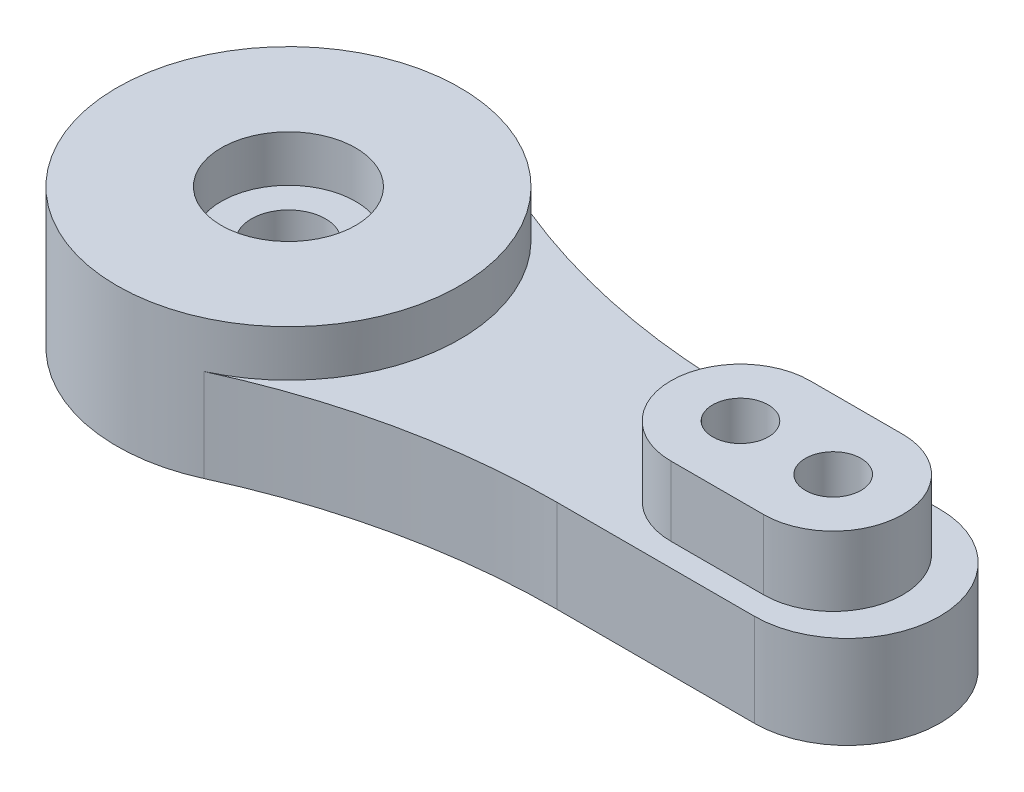
ISO-10303-21;
HEADER;
FILE_DESCRIPTION(('STEP AP214'),'2;1');
FILE_NAME('part.step','',(''),(''),'','','');
FILE_SCHEMA(('AUTOMOTIVE_DESIGN { 1 0 10303 214 1 1 1 1 }'));
ENDSEC;
DATA;
#1=APPLICATION_CONTEXT('core data for automotive mechanical design processes');
#2=APPLICATION_PROTOCOL_DEFINITION('international standard','automotive_design',2000,#1);
#3=PRODUCT_CONTEXT('',#1,'mechanical');
#4=PRODUCT('Part','Part','',(#3));
#5=PRODUCT_RELATED_PRODUCT_CATEGORY('part','',(#4));
#6=PRODUCT_DEFINITION_FORMATION('','',#4);
#7=PRODUCT_DEFINITION_CONTEXT('part definition',#1,'design');
#8=PRODUCT_DEFINITION('design','',#6,#7);
#9=PRODUCT_DEFINITION_SHAPE('','',#8);
#10=(LENGTH_UNIT() NAMED_UNIT(*) SI_UNIT(.MILLI.,.METRE.));
#11=(NAMED_UNIT(*) PLANE_ANGLE_UNIT() SI_UNIT($,.RADIAN.));
#12=(NAMED_UNIT(*) SI_UNIT($,.STERADIAN.) SOLID_ANGLE_UNIT());
#13=UNCERTAINTY_MEASURE_WITH_UNIT(LENGTH_MEASURE(1.E-05),#10,'distance_accuracy_value','');
#14=(GEOMETRIC_REPRESENTATION_CONTEXT(3) GLOBAL_UNCERTAINTY_ASSIGNED_CONTEXT((#13)) GLOBAL_UNIT_ASSIGNED_CONTEXT((#10,
#11,#12)) REPRESENTATION_CONTEXT('',''));
#15=CARTESIAN_POINT('',(0.,0.,0.));
#16=DIRECTION('',(0.,0.,1.));
#17=DIRECTION('',(1.,0.,0.));
#18=AXIS2_PLACEMENT_3D('',#15,#16,#17);
#19=CARTESIAN_POINT('',(0.,4.,0.));
#20=DIRECTION('',(0.,1.,0.));
#21=DIRECTION('',(0.,0.,1.));
#22=AXIS2_PLACEMENT_3D('',#19,#20,#21);
#23=PLANE('',#22);
#24=DIRECTION('',(1.,0.,0.));
#25=VECTOR('',#24,1.);
#26=CARTESIAN_POINT('',(19.5,4.,3.));
#27=LINE('',#26,#25);
#28=CARTESIAN_POINT('',(19.5,4.,3.));
#29=VERTEX_POINT('',#28);
#30=CARTESIAN_POINT('',(23.5,4.,3.));
#31=VERTEX_POINT('',#30);
#32=EDGE_CURVE('E239',#29,#31,#27,.T.);
#33=ORIENTED_EDGE('',*,*,#32,.F.);
#34=CARTESIAN_POINT('',(19.5,4.,0.));
#35=DIRECTION('',(0.,1.,0.));
#36=DIRECTION('',(0.,0.,1.));
#37=AXIS2_PLACEMENT_3D('',#34,#35,#36);
#38=CIRCLE('',#37,3.);
#39=CARTESIAN_POINT('',(19.5,4.,-3.));
#40=VERTEX_POINT('',#39);
#41=EDGE_CURVE('E217',#40,#29,#38,.T.);
#42=ORIENTED_EDGE('',*,*,#41,.F.);
#43=DIRECTION('',(-1.,0.,0.));
#44=VECTOR('',#43,1.);
#45=CARTESIAN_POINT('',(19.5,4.,-3.));
#46=LINE('',#45,#44);
#47=CARTESIAN_POINT('',(23.5,4.,-3.));
#48=VERTEX_POINT('',#47);
#49=EDGE_CURVE('E223',#48,#40,#46,.T.);
#50=ORIENTED_EDGE('',*,*,#49,.F.);
#51=CARTESIAN_POINT('',(23.5,4.,0.));
#52=DIRECTION('',(0.,1.,0.));
#53=DIRECTION('',(0.,0.,1.));
#54=AXIS2_PLACEMENT_3D('',#51,#52,#53);
#55=CIRCLE('',#54,3.);
#56=EDGE_CURVE('E243',#31,#48,#55,.T.);
#57=ORIENTED_EDGE('',*,*,#56,.F.);
#58=EDGE_LOOP('',(#33,#42,#50,#57));
#59=FACE_BOUND('',#58,.T.);
#60=CARTESIAN_POINT('',(15.5807573628499,4.,-34.));
#61=DIRECTION('',(0.,1.,0.));
#62=DIRECTION('',(0.,0.,1.));
#63=AXIS2_PLACEMENT_3D('',#60,#61,#62);
#64=CIRCLE('',#63,30.);
#65=CARTESIAN_POINT('',(3.08282364933393,4.,-6.72727272727273));
#66=VERTEX_POINT('',#65);
#67=CARTESIAN_POINT('',(15.5807573628499,4.,-4.));
#68=VERTEX_POINT('',#67);
#69=EDGE_CURVE('E134',#66,#68,#64,.T.);
#70=ORIENTED_EDGE('',*,*,#69,.F.);
#71=CARTESIAN_POINT('',(0.,4.,0.));
#72=DIRECTION('',(0.,1.,0.));
#73=DIRECTION('',(0.,0.,1.));
#74=AXIS2_PLACEMENT_3D('',#71,#72,#73);
#75=CIRCLE('',#74,7.4);
#76=CARTESIAN_POINT('',(3.08282364933393,4.,6.72727272727273));
#77=VERTEX_POINT('',#76);
#78=EDGE_CURVE('E197',#77,#66,#75,.T.);
#79=ORIENTED_EDGE('',*,*,#78,.F.);
#80=CARTESIAN_POINT('',(15.5807573628499,4.,34.));
#81=DIRECTION('',(0.,1.,0.));
#82=DIRECTION('',(0.,0.,1.));
#83=AXIS2_PLACEMENT_3D('',#80,#81,#82);
#84=CIRCLE('',#83,30.);
#85=CARTESIAN_POINT('',(15.5807573628499,4.,4.));
#86=VERTEX_POINT('',#85);
#87=EDGE_CURVE('E176',#77,#86,#84,.F.);
#88=ORIENTED_EDGE('',*,*,#87,.T.);
#89=DIRECTION('',(1.,0.,0.));
#90=VECTOR('',#89,1.);
#91=CARTESIAN_POINT('',(0.,4.,4.));
#92=LINE('',#91,#90);
#93=CARTESIAN_POINT('',(24.1,4.,4.));
#94=VERTEX_POINT('',#93);
#95=EDGE_CURVE('E102',#86,#94,#92,.T.);
#96=ORIENTED_EDGE('',*,*,#95,.T.);
#97=CARTESIAN_POINT('',(24.1,4.,0.));
#98=DIRECTION('',(0.,1.,0.));
#99=DIRECTION('',(0.,0.,1.));
#100=AXIS2_PLACEMENT_3D('',#97,#98,#99);
#101=CIRCLE('',#100,4.);
#102=CARTESIAN_POINT('',(24.1,4.,-4.));
#103=VERTEX_POINT('',#102);
#104=EDGE_CURVE('E112',#94,#103,#101,.T.);
#105=ORIENTED_EDGE('',*,*,#104,.T.);
#106=DIRECTION('',(1.,0.,0.));
#107=VECTOR('',#106,1.);
#108=CARTESIAN_POINT('',(0.,4.,-4.));
#109=LINE('',#108,#107);
#110=EDGE_CURVE('E115',#68,#103,#109,.T.);
#111=ORIENTED_EDGE('',*,*,#110,.F.);
#112=EDGE_LOOP('',(#70,#79,#88,#96,#105,#111));
#113=FACE_BOUND('',#112,.T.);
#114=ADVANCED_FACE('F41',(#59,#113),#23,.T.);
#115=CARTESIAN_POINT('',(0.,4.,0.));
#116=DIRECTION('',(0.,1.,0.));
#117=DIRECTION('',(0.,0.,1.));
#118=AXIS2_PLACEMENT_3D('',#115,#116,#117);
#119=CIRCLE('',#118,2.9);
#120=CARTESIAN_POINT('',(0.,4.,2.9));
#121=VERTEX_POINT('',#120);
#122=EDGE_CURVE('E11',#121,#121,#119,.F.);
#123=ORIENTED_EDGE('',*,*,#122,.F.);
#124=EDGE_LOOP('',(#123));
#125=FACE_BOUND('',#124,.T.);
#126=CARTESIAN_POINT('',(0.,4.,0.));
#127=DIRECTION('',(0.,1.,0.));
#128=DIRECTION('',(0.,0.,1.));
#129=AXIS2_PLACEMENT_3D('',#126,#127,#128);
#130=CIRCLE('',#129,1.6);
#131=CARTESIAN_POINT('',(0.,4.,1.6));
#132=VERTEX_POINT('',#131);
#133=EDGE_CURVE('E137',#132,#132,#130,.T.);
#134=ORIENTED_EDGE('',*,*,#133,.F.);
#135=EDGE_LOOP('',(#134));
#136=FACE_BOUND('',#135,.T.);
#137=ADVANCED_FACE('F282',(#125,#136),#23,.T.);
#138=CARTESIAN_POINT('',(15.5807573628499,4.,34.));
#139=DIRECTION('',(0.,-1.,0.));
#140=DIRECTION('',(0.,0.,-1.));
#141=AXIS2_PLACEMENT_3D('',#138,#139,#140);
#142=CYLINDRICAL_SURFACE('',#141,30.);
#143=CARTESIAN_POINT('',(15.5807573628499,0.,34.));
#144=DIRECTION('',(0.,1.,0.));
#145=DIRECTION('',(0.,0.,1.));
#146=AXIS2_PLACEMENT_3D('',#143,#144,#145);
#147=CIRCLE('',#146,30.);
#148=CARTESIAN_POINT('',(3.08282364933393,0.,6.72727272727273));
#149=VERTEX_POINT('',#148);
#150=CARTESIAN_POINT('',(15.5807573628499,0.,4.));
#151=VERTEX_POINT('',#150);
#152=EDGE_CURVE('E145',#149,#151,#147,.F.);
#153=ORIENTED_EDGE('',*,*,#152,.T.);
#154=DIRECTION('',(0.,-1.,0.));
#155=VECTOR('',#154,1.);
#156=CARTESIAN_POINT('',(15.5807573628499,4.,4.));
#157=LINE('',#156,#155);
#158=EDGE_CURVE('E50',#86,#151,#157,.T.);
#159=ORIENTED_EDGE('',*,*,#158,.F.);
#160=ORIENTED_EDGE('',*,*,#87,.F.);
#161=DIRECTION('',(0.,-1.,0.));
#162=VECTOR('',#161,1.);
#163=CARTESIAN_POINT('',(3.08282364933393,4.,6.72727272727273));
#164=LINE('',#163,#162);
#165=EDGE_CURVE('E144',#77,#149,#164,.T.);
#166=ORIENTED_EDGE('',*,*,#165,.T.);
#167=EDGE_LOOP('',(#153,#159,#160,#166));
#168=FACE_BOUND('',#167,.T.);
#169=ADVANCED_FACE('F43',(#168),#142,.F.);
#170=CARTESIAN_POINT('',(0.,4.,4.));
#171=DIRECTION('',(0.,0.,-1.));
#172=DIRECTION('',(-1.,0.,0.));
#173=AXIS2_PLACEMENT_3D('',#170,#171,#172);
#174=PLANE('',#173);
#175=DIRECTION('',(1.,0.,0.));
#176=VECTOR('',#175,1.);
#177=CARTESIAN_POINT('',(0.,0.,4.));
#178=LINE('',#177,#176);
#179=CARTESIAN_POINT('',(24.1,0.,4.));
#180=VERTEX_POINT('',#179);
#181=EDGE_CURVE('E149',#151,#180,#178,.T.);
#182=ORIENTED_EDGE('',*,*,#181,.T.);
#183=DIRECTION('',(0.,-1.,0.));
#184=VECTOR('',#183,1.);
#185=CARTESIAN_POINT('',(24.1,4.,4.));
#186=LINE('',#185,#184);
#187=EDGE_CURVE('E129',#94,#180,#186,.T.);
#188=ORIENTED_EDGE('',*,*,#187,.F.);
#189=ORIENTED_EDGE('',*,*,#95,.F.);
#190=ORIENTED_EDGE('',*,*,#158,.T.);
#191=EDGE_LOOP('',(#182,#188,#189,#190));
#192=FACE_BOUND('',#191,.T.);
#193=ADVANCED_FACE('F186',(#192),#174,.F.);
#194=CARTESIAN_POINT('',(24.1,4.,0.));
#195=DIRECTION('',(0.,-1.,0.));
#196=DIRECTION('',(0.,0.,-1.));
#197=AXIS2_PLACEMENT_3D('',#194,#195,#196);
#198=CYLINDRICAL_SURFACE('',#197,4.);
#199=CARTESIAN_POINT('',(24.1,0.,0.));
#200=DIRECTION('',(0.,1.,0.));
#201=DIRECTION('',(0.,0.,1.));
#202=AXIS2_PLACEMENT_3D('',#199,#200,#201);
#203=CIRCLE('',#202,4.);
#204=CARTESIAN_POINT('',(24.1,0.,-4.));
#205=VERTEX_POINT('',#204);
#206=EDGE_CURVE('E124',#180,#205,#203,.T.);
#207=ORIENTED_EDGE('',*,*,#206,.T.);
#208=DIRECTION('',(0.,-1.,0.));
#209=VECTOR('',#208,1.);
#210=CARTESIAN_POINT('',(24.1,4.,-4.));
#211=LINE('',#210,#209);
#212=EDGE_CURVE('E121',#103,#205,#211,.T.);
#213=ORIENTED_EDGE('',*,*,#212,.F.);
#214=ORIENTED_EDGE('',*,*,#104,.F.);
#215=ORIENTED_EDGE('',*,*,#187,.T.);
#216=EDGE_LOOP('',(#207,#213,#214,#215));
#217=FACE_BOUND('',#216,.T.);
#218=ADVANCED_FACE('F122',(#217),#198,.T.);
#219=CARTESIAN_POINT('',(0.,4.,-4.));
#220=DIRECTION('',(0.,0.,-1.));
#221=DIRECTION('',(-1.,0.,0.));
#222=AXIS2_PLACEMENT_3D('',#219,#220,#221);
#223=PLANE('',#222);
#224=DIRECTION('',(1.,0.,0.));
#225=VECTOR('',#224,1.);
#226=CARTESIAN_POINT('',(0.,0.,-4.));
#227=LINE('',#226,#225);
#228=CARTESIAN_POINT('',(15.5807573628499,0.,-4.));
#229=VERTEX_POINT('',#228);
#230=EDGE_CURVE('E155',#229,#205,#227,.T.);
#231=ORIENTED_EDGE('',*,*,#230,.F.);
#232=DIRECTION('',(0.,-1.,0.));
#233=VECTOR('',#232,1.);
#234=CARTESIAN_POINT('',(15.5807573628499,4.,-4.));
#235=LINE('',#234,#233);
#236=EDGE_CURVE('E130',#68,#229,#235,.T.);
#237=ORIENTED_EDGE('',*,*,#236,.F.);
#238=ORIENTED_EDGE('',*,*,#110,.T.);
#239=ORIENTED_EDGE('',*,*,#212,.T.);
#240=EDGE_LOOP('',(#231,#237,#238,#239));
#241=FACE_BOUND('',#240,.T.);
#242=ADVANCED_FACE('F132',(#241),#223,.T.);
#243=CARTESIAN_POINT('',(15.5807573628499,4.,-34.));
#244=DIRECTION('',(0.,-1.,0.));
#245=DIRECTION('',(0.,0.,-1.));
#246=AXIS2_PLACEMENT_3D('',#243,#244,#245);
#247=CYLINDRICAL_SURFACE('',#246,30.);
#248=CARTESIAN_POINT('',(15.5807573628499,0.,-34.));
#249=DIRECTION('',(0.,1.,0.));
#250=DIRECTION('',(0.,0.,1.));
#251=AXIS2_PLACEMENT_3D('',#248,#249,#250);
#252=CIRCLE('',#251,30.);
#253=CARTESIAN_POINT('',(3.08282364933393,0.,-6.72727272727273));
#254=VERTEX_POINT('',#253);
#255=EDGE_CURVE('E158',#254,#229,#252,.T.);
#256=ORIENTED_EDGE('',*,*,#255,.F.);
#257=DIRECTION('',(0.,-1.,0.));
#258=VECTOR('',#257,1.);
#259=CARTESIAN_POINT('',(3.08282364933393,4.,-6.72727272727273));
#260=LINE('',#259,#258);
#261=EDGE_CURVE('E66',#66,#254,#260,.T.);
#262=ORIENTED_EDGE('',*,*,#261,.F.);
#263=ORIENTED_EDGE('',*,*,#69,.T.);
#264=ORIENTED_EDGE('',*,*,#236,.T.);
#265=EDGE_LOOP('',(#256,#262,#263,#264));
#266=FACE_BOUND('',#265,.T.);
#267=ADVANCED_FACE('F193',(#266),#247,.F.);
#268=CARTESIAN_POINT('',(19.5,4.,0.));
#269=DIRECTION('',(0.,-1.,0.));
#270=DIRECTION('',(0.,0.,-1.));
#271=AXIS2_PLACEMENT_3D('',#268,#269,#270);
#272=CYLINDRICAL_SURFACE('',#271,1.2);
#273=CARTESIAN_POINT('',(19.5,0.,0.));
#274=DIRECTION('',(0.,1.,0.));
#275=DIRECTION('',(0.,0.,1.));
#276=AXIS2_PLACEMENT_3D('',#273,#274,#275);
#277=CIRCLE('',#276,1.2);
#278=CARTESIAN_POINT('',(19.5,0.,1.2));
#279=VERTEX_POINT('',#278);
#280=EDGE_CURVE('E168',#279,#279,#277,.T.);
#281=ORIENTED_EDGE('',*,*,#280,.F.);
#282=EDGE_LOOP('',(#281));
#283=FACE_BOUND('',#282,.T.);
#284=CARTESIAN_POINT('',(19.5,7.,0.));
#285=DIRECTION('',(0.,1.,0.));
#286=DIRECTION('',(0.,0.,1.));
#287=AXIS2_PLACEMENT_3D('',#284,#285,#286);
#288=CIRCLE('',#287,1.2);
#289=CARTESIAN_POINT('',(19.5,7.,1.2));
#290=VERTEX_POINT('',#289);
#291=EDGE_CURVE('E213',#290,#290,#288,.T.);
#292=ORIENTED_EDGE('',*,*,#291,.T.);
#293=EDGE_LOOP('',(#292));
#294=FACE_BOUND('',#293,.T.);
#295=ADVANCED_FACE('F277',(#283,#294),#272,.F.);
#296=CARTESIAN_POINT('',(0.,4.,0.));
#297=DIRECTION('',(0.,-1.,0.));
#298=DIRECTION('',(0.,0.,-1.));
#299=AXIS2_PLACEMENT_3D('',#296,#297,#298);
#300=CYLINDRICAL_SURFACE('',#299,1.6);
#301=ORIENTED_EDGE('',*,*,#133,.T.);
#302=EDGE_LOOP('',(#301));
#303=FACE_BOUND('',#302,.T.);
#304=CARTESIAN_POINT('',(0.,0.,0.));
#305=DIRECTION('',(0.,1.,0.));
#306=DIRECTION('',(0.,0.,1.));
#307=AXIS2_PLACEMENT_3D('',#304,#305,#306);
#308=CIRCLE('',#307,1.6);
#309=CARTESIAN_POINT('',(0.,0.,1.6));
#310=VERTEX_POINT('',#309);
#311=EDGE_CURVE('E164',#310,#310,#308,.T.);
#312=ORIENTED_EDGE('',*,*,#311,.F.);
#313=EDGE_LOOP('',(#312));
#314=FACE_BOUND('',#313,.T.);
#315=ADVANCED_FACE('F269',(#303,#314),#300,.F.);
#316=CARTESIAN_POINT('',(0.,4.,0.));
#317=DIRECTION('',(0.,-1.,0.));
#318=DIRECTION('',(0.,0.,-1.));
#319=AXIS2_PLACEMENT_3D('',#316,#317,#318);
#320=CYLINDRICAL_SURFACE('',#319,7.4);
#321=CARTESIAN_POINT('',(0.,0.,0.));
#322=DIRECTION('',(0.,1.,0.));
#323=DIRECTION('',(0.,0.,1.));
#324=AXIS2_PLACEMENT_3D('',#321,#322,#323);
#325=CIRCLE('',#324,7.4);
#326=EDGE_CURVE('E93',#254,#149,#325,.T.);
#327=ORIENTED_EDGE('',*,*,#326,.T.);
#328=ORIENTED_EDGE('',*,*,#165,.F.);
#329=ORIENTED_EDGE('',*,*,#78,.T.);
#330=ORIENTED_EDGE('',*,*,#261,.T.);
#331=EDGE_LOOP('',(#327,#328,#329,#330));
#332=FACE_BOUND('',#331,.T.);
#333=CARTESIAN_POINT('',(0.,6.,0.));
#334=DIRECTION('',(0.,1.,0.));
#335=DIRECTION('',(0.,0.,1.));
#336=AXIS2_PLACEMENT_3D('',#333,#334,#335);
#337=CIRCLE('',#336,7.4);
#338=CARTESIAN_POINT('',(0.,6.,7.4));
#339=VERTEX_POINT('',#338);
#340=EDGE_CURVE('E205',#339,#339,#337,.T.);
#341=ORIENTED_EDGE('',*,*,#340,.F.);
#342=EDGE_LOOP('',(#341));
#343=FACE_BOUND('',#342,.T.);
#344=ADVANCED_FACE('F198',(#332,#343),#320,.T.);
#345=CARTESIAN_POINT('',(23.5,4.,0.));
#346=DIRECTION('',(0.,-1.,0.));
#347=DIRECTION('',(0.,0.,-1.));
#348=AXIS2_PLACEMENT_3D('',#345,#346,#347);
#349=CYLINDRICAL_SURFACE('',#348,1.2);
#350=CARTESIAN_POINT('',(23.5,0.,0.));
#351=DIRECTION('',(0.,1.,0.));
#352=DIRECTION('',(0.,0.,1.));
#353=AXIS2_PLACEMENT_3D('',#350,#351,#352);
#354=CIRCLE('',#353,1.2);
#355=CARTESIAN_POINT('',(23.5,0.,1.2));
#356=VERTEX_POINT('',#355);
#357=EDGE_CURVE('E172',#356,#356,#354,.T.);
#358=ORIENTED_EDGE('',*,*,#357,.F.);
#359=EDGE_LOOP('',(#358));
#360=FACE_BOUND('',#359,.T.);
#361=CARTESIAN_POINT('',(23.5,7.,0.));
#362=DIRECTION('',(0.,1.,0.));
#363=DIRECTION('',(0.,0.,1.));
#364=AXIS2_PLACEMENT_3D('',#361,#362,#363);
#365=CIRCLE('',#364,1.2);
#366=CARTESIAN_POINT('',(23.5,7.,1.2));
#367=VERTEX_POINT('',#366);
#368=EDGE_CURVE('E209',#367,#367,#365,.T.);
#369=ORIENTED_EDGE('',*,*,#368,.T.);
#370=EDGE_LOOP('',(#369));
#371=FACE_BOUND('',#370,.T.);
#372=ADVANCED_FACE('F268',(#360,#371),#349,.F.);
#373=CARTESIAN_POINT('',(0.,0.,0.));
#374=DIRECTION('',(0.,1.,0.));
#375=DIRECTION('',(0.,0.,1.));
#376=AXIS2_PLACEMENT_3D('',#373,#374,#375);
#377=PLANE('',#376);
#378=ORIENTED_EDGE('',*,*,#152,.F.);
#379=ORIENTED_EDGE('',*,*,#326,.F.);
#380=ORIENTED_EDGE('',*,*,#255,.T.);
#381=ORIENTED_EDGE('',*,*,#230,.T.);
#382=ORIENTED_EDGE('',*,*,#206,.F.);
#383=ORIENTED_EDGE('',*,*,#181,.F.);
#384=EDGE_LOOP('',(#378,#379,#380,#381,#382,#383));
#385=FACE_BOUND('',#384,.T.);
#386=ORIENTED_EDGE('',*,*,#311,.T.);
#387=EDGE_LOOP('',(#386));
#388=FACE_BOUND('',#387,.T.);
#389=ORIENTED_EDGE('',*,*,#280,.T.);
#390=EDGE_LOOP('',(#389));
#391=FACE_BOUND('',#390,.T.);
#392=ORIENTED_EDGE('',*,*,#357,.T.);
#393=EDGE_LOOP('',(#392));
#394=FACE_BOUND('',#393,.T.);
#395=ADVANCED_FACE('F191',(#385,#388,#391,#394),#377,.F.);
#396=CARTESIAN_POINT('',(19.5,7.,0.));
#397=DIRECTION('',(0.,1.,0.));
#398=DIRECTION('',(0.,0.,1.));
#399=AXIS2_PLACEMENT_3D('',#396,#397,#398);
#400=PLANE('',#399);
#401=ORIENTED_EDGE('',*,*,#291,.F.);
#402=EDGE_LOOP('',(#401));
#403=FACE_BOUND('',#402,.T.);
#404=CARTESIAN_POINT('',(19.5,7.,0.));
#405=DIRECTION('',(0.,1.,0.));
#406=DIRECTION('',(0.,0.,1.));
#407=AXIS2_PLACEMENT_3D('',#404,#405,#406);
#408=CIRCLE('',#407,3.);
#409=CARTESIAN_POINT('',(19.5,7.,-3.));
#410=VERTEX_POINT('',#409);
#411=CARTESIAN_POINT('',(19.5,7.,3.));
#412=VERTEX_POINT('',#411);
#413=EDGE_CURVE('E218',#410,#412,#408,.T.);
#414=ORIENTED_EDGE('',*,*,#413,.T.);
#415=DIRECTION('',(1.,0.,0.));
#416=VECTOR('',#415,1.);
#417=CARTESIAN_POINT('',(19.5,7.,3.));
#418=LINE('',#417,#416);
#419=CARTESIAN_POINT('',(23.5,7.,3.));
#420=VERTEX_POINT('',#419);
#421=EDGE_CURVE('E222',#412,#420,#418,.T.);
#422=ORIENTED_EDGE('',*,*,#421,.T.);
#423=CARTESIAN_POINT('',(23.5,7.,0.));
#424=DIRECTION('',(0.,1.,0.));
#425=DIRECTION('',(0.,0.,1.));
#426=AXIS2_PLACEMENT_3D('',#423,#424,#425);
#427=CIRCLE('',#426,3.);
#428=CARTESIAN_POINT('',(23.5,7.,-3.));
#429=VERTEX_POINT('',#428);
#430=EDGE_CURVE('E227',#420,#429,#427,.T.);
#431=ORIENTED_EDGE('',*,*,#430,.T.);
#432=DIRECTION('',(-1.,0.,0.));
#433=VECTOR('',#432,1.);
#434=CARTESIAN_POINT('',(19.5,7.,-3.));
#435=LINE('',#434,#433);
#436=EDGE_CURVE('E231',#429,#410,#435,.T.);
#437=ORIENTED_EDGE('',*,*,#436,.T.);
#438=EDGE_LOOP('',(#414,#422,#431,#437));
#439=FACE_BOUND('',#438,.T.);
#440=ORIENTED_EDGE('',*,*,#368,.F.);
#441=EDGE_LOOP('',(#440));
#442=FACE_BOUND('',#441,.T.);
#443=ADVANCED_FACE('F295',(#403,#439,#442),#400,.T.);
#444=CARTESIAN_POINT('',(19.5,7.,0.));
#445=DIRECTION('',(0.,-1.,0.));
#446=DIRECTION('',(0.,0.,-1.));
#447=AXIS2_PLACEMENT_3D('',#444,#445,#446);
#448=CYLINDRICAL_SURFACE('',#447,3.);
#449=ORIENTED_EDGE('',*,*,#41,.T.);
#450=DIRECTION('',(0.,-1.,0.));
#451=VECTOR('',#450,1.);
#452=CARTESIAN_POINT('',(19.5,7.,3.));
#453=LINE('',#452,#451);
#454=EDGE_CURVE('E150',#412,#29,#453,.T.);
#455=ORIENTED_EDGE('',*,*,#454,.F.);
#456=ORIENTED_EDGE('',*,*,#413,.F.);
#457=DIRECTION('',(0.,-1.,0.));
#458=VECTOR('',#457,1.);
#459=CARTESIAN_POINT('',(19.5,7.,-3.));
#460=LINE('',#459,#458);
#461=EDGE_CURVE('E235',#410,#40,#460,.T.);
#462=ORIENTED_EDGE('',*,*,#461,.T.);
#463=EDGE_LOOP('',(#449,#455,#456,#462));
#464=FACE_BOUND('',#463,.T.);
#465=ADVANCED_FACE('F292',(#464),#448,.T.);
#466=CARTESIAN_POINT('',(19.5,7.,3.));
#467=DIRECTION('',(0.,0.,-1.));
#468=DIRECTION('',(-1.,0.,0.));
#469=AXIS2_PLACEMENT_3D('',#466,#467,#468);
#470=PLANE('',#469);
#471=ORIENTED_EDGE('',*,*,#32,.T.);
#472=DIRECTION('',(0.,-1.,0.));
#473=VECTOR('',#472,1.);
#474=CARTESIAN_POINT('',(23.5,7.,3.));
#475=LINE('',#474,#473);
#476=EDGE_CURVE('E253',#420,#31,#475,.T.);
#477=ORIENTED_EDGE('',*,*,#476,.F.);
#478=ORIENTED_EDGE('',*,*,#421,.F.);
#479=ORIENTED_EDGE('',*,*,#454,.T.);
#480=EDGE_LOOP('',(#471,#477,#478,#479));
#481=FACE_BOUND('',#480,.T.);
#482=ADVANCED_FACE('F324',(#481),#470,.F.);
#483=CARTESIAN_POINT('',(23.5,7.,0.));
#484=DIRECTION('',(0.,-1.,0.));
#485=DIRECTION('',(0.,0.,-1.));
#486=AXIS2_PLACEMENT_3D('',#483,#484,#485);
#487=CYLINDRICAL_SURFACE('',#486,3.);
#488=ORIENTED_EDGE('',*,*,#56,.T.);
#489=DIRECTION('',(0.,-1.,0.));
#490=VECTOR('',#489,1.);
#491=CARTESIAN_POINT('',(23.5,7.,-3.));
#492=LINE('',#491,#490);
#493=EDGE_CURVE('E57',#429,#48,#492,.T.);
#494=ORIENTED_EDGE('',*,*,#493,.F.);
#495=ORIENTED_EDGE('',*,*,#430,.F.);
#496=ORIENTED_EDGE('',*,*,#476,.T.);
#497=EDGE_LOOP('',(#488,#494,#495,#496));
#498=FACE_BOUND('',#497,.T.);
#499=ADVANCED_FACE('F334',(#498),#487,.T.);
#500=CARTESIAN_POINT('',(19.5,7.,-3.));
#501=DIRECTION('',(0.,0.,1.));
#502=DIRECTION('',(1.,0.,0.));
#503=AXIS2_PLACEMENT_3D('',#500,#501,#502);
#504=PLANE('',#503);
#505=ORIENTED_EDGE('',*,*,#49,.T.);
#506=ORIENTED_EDGE('',*,*,#461,.F.);
#507=ORIENTED_EDGE('',*,*,#436,.F.);
#508=ORIENTED_EDGE('',*,*,#493,.T.);
#509=EDGE_LOOP('',(#505,#506,#507,#508));
#510=FACE_BOUND('',#509,.T.);
#511=ADVANCED_FACE('F337',(#510),#504,.F.);
#512=CARTESIAN_POINT('',(0.,6.,0.));
#513=DIRECTION('',(0.,-1.,0.));
#514=DIRECTION('',(0.,0.,-1.));
#515=AXIS2_PLACEMENT_3D('',#512,#513,#514);
#516=CYLINDRICAL_SURFACE('',#515,2.9);
#517=CARTESIAN_POINT('',(0.,6.,0.));
#518=DIRECTION('',(0.,1.,0.));
#519=DIRECTION('',(0.,0.,1.));
#520=AXIS2_PLACEMENT_3D('',#517,#518,#519);
#521=CIRCLE('',#520,2.9);
#522=CARTESIAN_POINT('',(0.,6.,2.9));
#523=VERTEX_POINT('',#522);
#524=EDGE_CURVE('E201',#523,#523,#521,.T.);
#525=ORIENTED_EDGE('',*,*,#524,.T.);
#526=EDGE_LOOP('',(#525));
#527=FACE_BOUND('',#526,.T.);
#528=ORIENTED_EDGE('',*,*,#122,.T.);
#529=EDGE_LOOP('',(#528));
#530=FACE_BOUND('',#529,.T.);
#531=ADVANCED_FACE('F339',(#527,#530),#516,.F.);
#532=CARTESIAN_POINT('',(0.,6.,0.));
#533=DIRECTION('',(0.,1.,0.));
#534=DIRECTION('',(0.,0.,1.));
#535=AXIS2_PLACEMENT_3D('',#532,#533,#534);
#536=PLANE('',#535);
#537=ORIENTED_EDGE('',*,*,#524,.F.);
#538=EDGE_LOOP('',(#537));
#539=FACE_BOUND('',#538,.T.);
#540=ORIENTED_EDGE('',*,*,#340,.T.);
#541=EDGE_LOOP('',(#540));
#542=FACE_BOUND('',#541,.T.);
#543=ADVANCED_FACE('F266',(#539,#542),#536,.T.);
#544=CLOSED_SHELL('',(#114,#137,#169,#193,#218,#242,#267,#295,#315,#344,#372,#395,#443,#465,
#482,#499,#511,#531,#543));
#545=MANIFOLD_SOLID_BREP('B2',#544);
#546=ADVANCED_BREP_SHAPE_REPRESENTATION('',(#18,#545),#14);
#547=SHAPE_DEFINITION_REPRESENTATION(#9,#546);
ENDSEC;
END-ISO-10303-21;
